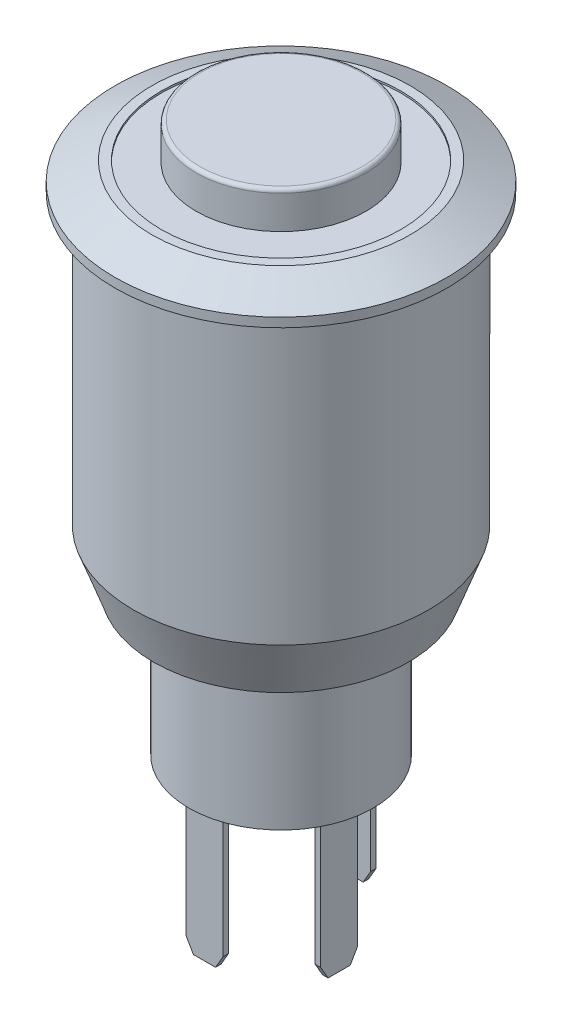
ISO-10303-21;
HEADER;
FILE_DESCRIPTION(('STEP AP214'),'2;1');
FILE_NAME('part.step','',(''),(''),'','','');
FILE_SCHEMA(('AUTOMOTIVE_DESIGN { 1 0 10303 214 1 1 1 1 }'));
ENDSEC;
DATA;
#1=APPLICATION_CONTEXT('core data for automotive mechanical design processes');
#2=APPLICATION_PROTOCOL_DEFINITION('international standard','automotive_design',2000,#1);
#3=PRODUCT_CONTEXT('',#1,'mechanical');
#4=PRODUCT('Part','Part','',(#3));
#5=PRODUCT_RELATED_PRODUCT_CATEGORY('part','',(#4));
#6=PRODUCT_DEFINITION_FORMATION('','',#4);
#7=PRODUCT_DEFINITION_CONTEXT('part definition',#1,'design');
#8=PRODUCT_DEFINITION('design','',#6,#7);
#9=PRODUCT_DEFINITION_SHAPE('','',#8);
#10=(LENGTH_UNIT() NAMED_UNIT(*) SI_UNIT(.MILLI.,.METRE.));
#11=(NAMED_UNIT(*) PLANE_ANGLE_UNIT() SI_UNIT($,.RADIAN.));
#12=(NAMED_UNIT(*) SI_UNIT($,.STERADIAN.) SOLID_ANGLE_UNIT());
#13=UNCERTAINTY_MEASURE_WITH_UNIT(LENGTH_MEASURE(1.E-05),#10,'distance_accuracy_value','');
#14=(GEOMETRIC_REPRESENTATION_CONTEXT(3) GLOBAL_UNCERTAINTY_ASSIGNED_CONTEXT((#13)) GLOBAL_UNIT_ASSIGNED_CONTEXT((#10,
#11,#12)) REPRESENTATION_CONTEXT('',''));
#15=CARTESIAN_POINT('',(0.,0.,0.));
#16=DIRECTION('',(0.,0.,1.));
#17=DIRECTION('',(1.,0.,0.));
#18=AXIS2_PLACEMENT_3D('',#15,#16,#17);
#19=CARTESIAN_POINT('',(0.,-26.4,5.));
#20=DIRECTION('',(0.,-1.,0.));
#21=DIRECTION('',(0.,0.,-1.));
#22=AXIS2_PLACEMENT_3D('',#19,#20,#21);
#23=PLANE('',#22);
#24=CARTESIAN_POINT('',(0.,-26.4,0.));
#25=DIRECTION('',(0.,1.,0.));
#26=DIRECTION('',(0.,0.,1.));
#27=AXIS2_PLACEMENT_3D('',#24,#25,#26);
#28=CIRCLE('',#27,5.);
#29=CARTESIAN_POINT('',(0.,-26.4,5.));
#30=VERTEX_POINT('',#29);
#31=EDGE_CURVE('E317',#30,#30,#28,.T.);
#32=ORIENTED_EDGE('',*,*,#31,.F.);
#33=EDGE_LOOP('',(#32));
#34=FACE_BOUND('',#33,.T.);
#35=DIRECTION('',(0.,0.,-1.));
#36=VECTOR('',#35,1.);
#37=CARTESIAN_POINT('',(0.999999999999999,-26.4,4.15));
#38=LINE('',#37,#36);
#39=CARTESIAN_POINT('',(0.999999999999999,-26.4,4.15));
#40=VERTEX_POINT('',#39);
#41=CARTESIAN_POINT('',(0.999999999999999,-26.4,3.85));
#42=VERTEX_POINT('',#41);
#43=EDGE_CURVE('E295',#40,#42,#38,.T.);
#44=ORIENTED_EDGE('',*,*,#43,.T.);
#45=DIRECTION('',(1.,0.,0.));
#46=VECTOR('',#45,1.);
#47=CARTESIAN_POINT('',(-1.,-26.4,3.85));
#48=LINE('',#47,#46);
#49=CARTESIAN_POINT('',(-1.,-26.4,3.85));
#50=VERTEX_POINT('',#49);
#51=EDGE_CURVE('E284',#50,#42,#48,.T.);
#52=ORIENTED_EDGE('',*,*,#51,.F.);
#53=DIRECTION('',(0.,0.,1.));
#54=VECTOR('',#53,1.);
#55=CARTESIAN_POINT('',(-1.,-26.4,3.85));
#56=LINE('',#55,#54);
#57=CARTESIAN_POINT('',(-1.,-26.4,4.15));
#58=VERTEX_POINT('',#57);
#59=EDGE_CURVE('E289',#50,#58,#56,.T.);
#60=ORIENTED_EDGE('',*,*,#59,.T.);
#61=DIRECTION('',(1.,0.,0.));
#62=VECTOR('',#61,1.);
#63=CARTESIAN_POINT('',(-1.,-26.4,4.15));
#64=LINE('',#63,#62);
#65=EDGE_CURVE('E298',#58,#40,#64,.T.);
#66=ORIENTED_EDGE('',*,*,#65,.T.);
#67=EDGE_LOOP('',(#44,#52,#60,#66));
#68=FACE_BOUND('',#67,.T.);
#69=DIRECTION('',(0.,0.,-1.));
#70=VECTOR('',#69,1.);
#71=CARTESIAN_POINT('',(0.999999999999999,-26.4,-3.85));
#72=LINE('',#71,#70);
#73=CARTESIAN_POINT('',(0.999999999999999,-26.4,-3.85));
#74=VERTEX_POINT('',#73);
#75=CARTESIAN_POINT('',(0.999999999999999,-26.4,-4.15));
#76=VERTEX_POINT('',#75);
#77=EDGE_CURVE('E269',#74,#76,#72,.T.);
#78=ORIENTED_EDGE('',*,*,#77,.T.);
#79=DIRECTION('',(1.,0.,0.));
#80=VECTOR('',#79,1.);
#81=CARTESIAN_POINT('',(-1.,-26.4,-4.15));
#82=LINE('',#81,#80);
#83=CARTESIAN_POINT('',(-1.,-26.4,-4.15));
#84=VERTEX_POINT('',#83);
#85=EDGE_CURVE('E258',#84,#76,#82,.T.);
#86=ORIENTED_EDGE('',*,*,#85,.F.);
#87=DIRECTION('',(0.,0.,1.));
#88=VECTOR('',#87,1.);
#89=CARTESIAN_POINT('',(-1.,-26.4,-4.15));
#90=LINE('',#89,#88);
#91=CARTESIAN_POINT('',(-1.,-26.4,-3.85));
#92=VERTEX_POINT('',#91);
#93=EDGE_CURVE('E263',#84,#92,#90,.T.);
#94=ORIENTED_EDGE('',*,*,#93,.T.);
#95=DIRECTION('',(1.,0.,0.));
#96=VECTOR('',#95,1.);
#97=CARTESIAN_POINT('',(-1.,-26.4,-3.85));
#98=LINE('',#97,#96);
#99=EDGE_CURVE('E272',#92,#74,#98,.T.);
#100=ORIENTED_EDGE('',*,*,#99,.T.);
#101=EDGE_LOOP('',(#78,#86,#94,#100));
#102=FACE_BOUND('',#101,.T.);
#103=DIRECTION('',(-1.,0.,0.));
#104=VECTOR('',#103,1.);
#105=CARTESIAN_POINT('',(-3.85,-26.4,-1.));
#106=LINE('',#105,#104);
#107=CARTESIAN_POINT('',(-3.85,-26.4,-1.));
#108=VERTEX_POINT('',#107);
#109=CARTESIAN_POINT('',(-4.15,-26.4,-1.));
#110=VERTEX_POINT('',#109);
#111=EDGE_CURVE('E243',#108,#110,#106,.T.);
#112=ORIENTED_EDGE('',*,*,#111,.T.);
#113=DIRECTION('',(0.,0.,1.));
#114=VECTOR('',#113,1.);
#115=CARTESIAN_POINT('',(-4.15,-26.4,1.));
#116=LINE('',#115,#114);
#117=CARTESIAN_POINT('',(-4.15,-26.4,1.));
#118=VERTEX_POINT('',#117);
#119=EDGE_CURVE('E232',#118,#110,#116,.F.);
#120=ORIENTED_EDGE('',*,*,#119,.F.);
#121=DIRECTION('',(1.,0.,0.));
#122=VECTOR('',#121,1.);
#123=CARTESIAN_POINT('',(-4.15,-26.4,1.));
#124=LINE('',#123,#122);
#125=CARTESIAN_POINT('',(-3.85,-26.4,1.));
#126=VERTEX_POINT('',#125);
#127=EDGE_CURVE('E237',#118,#126,#124,.T.);
#128=ORIENTED_EDGE('',*,*,#127,.T.);
#129=DIRECTION('',(0.,0.,1.));
#130=VECTOR('',#129,1.);
#131=CARTESIAN_POINT('',(-3.85,-26.4,1.));
#132=LINE('',#131,#130);
#133=EDGE_CURVE('E246',#126,#108,#132,.F.);
#134=ORIENTED_EDGE('',*,*,#133,.T.);
#135=EDGE_LOOP('',(#112,#120,#128,#134));
#136=FACE_BOUND('',#135,.T.);
#137=DIRECTION('',(1.,0.,0.));
#138=VECTOR('',#137,1.);
#139=CARTESIAN_POINT('',(3.85,-26.4,2.));
#140=LINE('',#139,#138);
#141=CARTESIAN_POINT('',(3.85,-26.4,2.));
#142=VERTEX_POINT('',#141);
#143=CARTESIAN_POINT('',(4.15,-26.4,2.));
#144=VERTEX_POINT('',#143);
#145=EDGE_CURVE('E216',#142,#144,#140,.T.);
#146=ORIENTED_EDGE('',*,*,#145,.T.);
#147=DIRECTION('',(0.,0.,1.));
#148=VECTOR('',#147,1.);
#149=CARTESIAN_POINT('',(4.15,-26.4,0.));
#150=LINE('',#149,#148);
#151=CARTESIAN_POINT('',(4.15,-26.4,0.));
#152=VERTEX_POINT('',#151);
#153=EDGE_CURVE('E199',#152,#144,#150,.T.);
#154=ORIENTED_EDGE('',*,*,#153,.F.);
#155=DIRECTION('',(-1.,0.,0.));
#156=VECTOR('',#155,1.);
#157=CARTESIAN_POINT('',(4.15,-26.4,0.));
#158=LINE('',#157,#156);
#159=CARTESIAN_POINT('',(3.85,-26.4,0.));
#160=VERTEX_POINT('',#159);
#161=EDGE_CURVE('E213',#152,#160,#158,.T.);
#162=ORIENTED_EDGE('',*,*,#161,.T.);
#163=DIRECTION('',(0.,0.,1.));
#164=VECTOR('',#163,1.);
#165=CARTESIAN_POINT('',(3.85,-26.4,0.));
#166=LINE('',#165,#164);
#167=EDGE_CURVE('E221',#160,#142,#166,.T.);
#168=ORIENTED_EDGE('',*,*,#167,.T.);
#169=EDGE_LOOP('',(#146,#154,#162,#168));
#170=FACE_BOUND('',#169,.T.);
#171=ADVANCED_FACE('F35',(#34,#68,#102,#136,#170),#23,.T.);
#172=CARTESIAN_POINT('',(0.,1.5,4.6));
#173=DIRECTION('',(0.,1.,0.));
#174=DIRECTION('',(0.,0.,1.));
#175=AXIS2_PLACEMENT_3D('',#172,#173,#174);
#176=PLANE('',#175);
#177=CARTESIAN_POINT('',(0.,1.5,0.));
#178=DIRECTION('',(0.,1.,0.));
#179=DIRECTION('',(0.,0.,1.));
#180=AXIS2_PLACEMENT_3D('',#177,#178,#179);
#181=CIRCLE('',#180,6.5);
#182=CARTESIAN_POINT('',(0.,1.5,6.5));
#183=VERTEX_POINT('',#182);
#184=EDGE_CURVE('E313',#183,#183,#181,.T.);
#185=ORIENTED_EDGE('',*,*,#184,.F.);
#186=EDGE_LOOP('',(#185));
#187=FACE_BOUND('',#186,.T.);
#188=CARTESIAN_POINT('',(0.,1.5,0.));
#189=DIRECTION('',(0.,1.,0.));
#190=DIRECTION('',(0.,0.,1.));
#191=AXIS2_PLACEMENT_3D('',#188,#189,#190);
#192=CIRCLE('',#191,7.);
#193=CARTESIAN_POINT('',(0.,1.5,7.));
#194=VERTEX_POINT('',#193);
#195=EDGE_CURVE('E334',#194,#194,#192,.T.);
#196=ORIENTED_EDGE('',*,*,#195,.T.);
#197=EDGE_LOOP('',(#196));
#198=FACE_BOUND('',#197,.T.);
#199=ADVANCED_FACE('F425',(#187,#198),#176,.T.);
#200=CARTESIAN_POINT('',(0.,1.5,0.));
#201=DIRECTION('',(0.,-1.,0.));
#202=DIRECTION('',(0.,0.,-1.));
#203=AXIS2_PLACEMENT_3D('',#200,#201,#202);
#204=CONICAL_SURFACE('',#203,7.,1.10714871779409);
#205=CARTESIAN_POINT('',(0.,0.5,0.));
#206=DIRECTION('',(0.,1.,0.));
#207=DIRECTION('',(0.,0.,1.));
#208=AXIS2_PLACEMENT_3D('',#205,#206,#207);
#209=CIRCLE('',#208,9.);
#210=CARTESIAN_POINT('',(0.,0.5,9.));
#211=VERTEX_POINT('',#210);
#212=EDGE_CURVE('E331',#211,#211,#209,.T.);
#213=ORIENTED_EDGE('',*,*,#212,.T.);
#214=EDGE_LOOP('',(#213));
#215=FACE_BOUND('',#214,.T.);
#216=ORIENTED_EDGE('',*,*,#195,.F.);
#217=EDGE_LOOP('',(#216));
#218=FACE_BOUND('',#217,.T.);
#219=ADVANCED_FACE('F431',(#215,#218),#204,.T.);
#220=CARTESIAN_POINT('',(0.,14.375,0.));
#221=DIRECTION('',(0.,1.,0.));
#222=DIRECTION('',(0.,0.,1.));
#223=AXIS2_PLACEMENT_3D('',#220,#221,#222);
#224=CYLINDRICAL_SURFACE('',#223,9.);
#225=CARTESIAN_POINT('',(0.,0.,0.));
#226=DIRECTION('',(0.,1.,0.));
#227=DIRECTION('',(0.,0.,1.));
#228=AXIS2_PLACEMENT_3D('',#225,#226,#227);
#229=CIRCLE('',#228,9.);
#230=CARTESIAN_POINT('',(0.,0.,9.));
#231=VERTEX_POINT('',#230);
#232=EDGE_CURVE('E328',#231,#231,#229,.T.);
#233=ORIENTED_EDGE('',*,*,#232,.T.);
#234=EDGE_LOOP('',(#233));
#235=FACE_BOUND('',#234,.T.);
#236=ORIENTED_EDGE('',*,*,#212,.F.);
#237=EDGE_LOOP('',(#236));
#238=FACE_BOUND('',#237,.T.);
#239=ADVANCED_FACE('F453',(#235,#238),#224,.T.);
#240=CARTESIAN_POINT('',(0.,0.,9.));
#241=DIRECTION('',(0.,-1.,0.));
#242=DIRECTION('',(0.,0.,-1.));
#243=AXIS2_PLACEMENT_3D('',#240,#241,#242);
#244=PLANE('',#243);
#245=CARTESIAN_POINT('',(0.,0.,0.));
#246=DIRECTION('',(0.,1.,0.));
#247=DIRECTION('',(0.,0.,1.));
#248=AXIS2_PLACEMENT_3D('',#245,#246,#247);
#249=CIRCLE('',#248,8.);
#250=CARTESIAN_POINT('',(0.,0.,8.));
#251=VERTEX_POINT('',#250);
#252=EDGE_CURVE('E325',#251,#251,#249,.T.);
#253=ORIENTED_EDGE('',*,*,#252,.T.);
#254=EDGE_LOOP('',(#253));
#255=FACE_BOUND('',#254,.T.);
#256=ORIENTED_EDGE('',*,*,#232,.F.);
#257=EDGE_LOOP('',(#256));
#258=FACE_BOUND('',#257,.T.);
#259=ADVANCED_FACE('F450',(#255,#258),#244,.T.);
#260=CARTESIAN_POINT('',(0.,14.375,0.));
#261=DIRECTION('',(0.,1.,0.));
#262=DIRECTION('',(0.,0.,1.));
#263=AXIS2_PLACEMENT_3D('',#260,#261,#262);
#264=CYLINDRICAL_SURFACE('',#263,8.);
#265=CARTESIAN_POINT('',(0.,-15.6,0.));
#266=DIRECTION('',(0.,-1.,0.));
#267=DIRECTION('',(0.,0.,-1.));
#268=AXIS2_PLACEMENT_3D('',#265,#266,#267);
#269=CIRCLE('',#268,8.);
#270=CARTESIAN_POINT('',(0.,-15.6,-8.));
#271=VERTEX_POINT('',#270);
#272=EDGE_CURVE('E43',#271,#271,#269,.F.);
#273=ORIENTED_EDGE('',*,*,#272,.T.);
#274=EDGE_LOOP('',(#273));
#275=FACE_BOUND('',#274,.T.);
#276=ORIENTED_EDGE('',*,*,#252,.F.);
#277=EDGE_LOOP('',(#276));
#278=FACE_BOUND('',#277,.T.);
#279=ADVANCED_FACE('F413',(#275,#278),#264,.T.);
#280=CARTESIAN_POINT('',(0.,-18.6,8.));
#281=DIRECTION('',(0.,-1.,0.));
#282=DIRECTION('',(0.,0.,-1.));
#283=AXIS2_PLACEMENT_3D('',#280,#281,#282);
#284=PLANE('',#283);
#285=CARTESIAN_POINT('',(0.,-18.6,0.));
#286=DIRECTION('',(0.,-1.,0.));
#287=DIRECTION('',(0.,0.,-1.));
#288=AXIS2_PLACEMENT_3D('',#285,#286,#287);
#289=CIRCLE('',#288,6.90808929720139);
#290=CARTESIAN_POINT('',(0.,-18.6,-6.90808929720139));
#291=VERTEX_POINT('',#290);
#292=EDGE_CURVE('E11',#291,#291,#289,.T.);
#293=ORIENTED_EDGE('',*,*,#292,.T.);
#294=EDGE_LOOP('',(#293));
#295=FACE_BOUND('',#294,.T.);
#296=CARTESIAN_POINT('',(0.,-18.6,0.));
#297=DIRECTION('',(0.,1.,0.));
#298=DIRECTION('',(0.,0.,1.));
#299=AXIS2_PLACEMENT_3D('',#296,#297,#298);
#300=CIRCLE('',#299,5.);
#301=CARTESIAN_POINT('',(0.,-18.6,5.));
#302=VERTEX_POINT('',#301);
#303=EDGE_CURVE('E322',#302,#302,#300,.T.);
#304=ORIENTED_EDGE('',*,*,#303,.T.);
#305=EDGE_LOOP('',(#304));
#306=FACE_BOUND('',#305,.T.);
#307=ADVANCED_FACE('F443',(#295,#306),#284,.T.);
#308=CARTESIAN_POINT('',(0.,14.375,0.));
#309=DIRECTION('',(0.,1.,0.));
#310=DIRECTION('',(0.,0.,1.));
#311=AXIS2_PLACEMENT_3D('',#308,#309,#310);
#312=CYLINDRICAL_SURFACE('',#311,5.);
#313=ORIENTED_EDGE('',*,*,#31,.T.);
#314=EDGE_LOOP('',(#313));
#315=FACE_BOUND('',#314,.T.);
#316=ORIENTED_EDGE('',*,*,#303,.F.);
#317=EDGE_LOOP('',(#316));
#318=FACE_BOUND('',#317,.T.);
#319=ADVANCED_FACE('F440',(#315,#318),#312,.T.);
#320=CARTESIAN_POINT('',(0.,1.4,0.));
#321=DIRECTION('',(0.,1.,0.));
#322=DIRECTION('',(0.,0.,1.));
#323=AXIS2_PLACEMENT_3D('',#320,#321,#322);
#324=CYLINDRICAL_SURFACE('',#323,6.5);
#325=CARTESIAN_POINT('',(0.,1.4,0.));
#326=DIRECTION('',(0.,1.,0.));
#327=DIRECTION('',(0.,0.,1.));
#328=AXIS2_PLACEMENT_3D('',#325,#326,#327);
#329=CIRCLE('',#328,6.5);
#330=CARTESIAN_POINT('',(0.,1.4,6.5));
#331=VERTEX_POINT('',#330);
#332=EDGE_CURVE('E314',#331,#331,#329,.T.);
#333=ORIENTED_EDGE('',*,*,#332,.F.);
#334=EDGE_LOOP('',(#333));
#335=FACE_BOUND('',#334,.T.);
#336=ORIENTED_EDGE('',*,*,#184,.T.);
#337=EDGE_LOOP('',(#336));
#338=FACE_BOUND('',#337,.T.);
#339=ADVANCED_FACE('F438',(#335,#338),#324,.F.);
#340=CARTESIAN_POINT('',(0.,1.4,0.));
#341=DIRECTION('',(0.,1.,0.));
#342=DIRECTION('',(0.,0.,1.));
#343=AXIS2_PLACEMENT_3D('',#340,#341,#342);
#344=PLANE('',#343);
#345=CARTESIAN_POINT('',(0.,1.4,0.));
#346=DIRECTION('',(0.,1.,0.));
#347=DIRECTION('',(0.,0.,1.));
#348=AXIS2_PLACEMENT_3D('',#345,#346,#347);
#349=CIRCLE('',#348,4.6);
#350=CARTESIAN_POINT('',(0.,1.4,4.6));
#351=VERTEX_POINT('',#350);
#352=EDGE_CURVE('E310',#351,#351,#349,.T.);
#353=ORIENTED_EDGE('',*,*,#352,.F.);
#354=EDGE_LOOP('',(#353));
#355=FACE_BOUND('',#354,.T.);
#356=ORIENTED_EDGE('',*,*,#332,.T.);
#357=EDGE_LOOP('',(#356));
#358=FACE_BOUND('',#357,.T.);
#359=ADVANCED_FACE('F470',(#355,#358),#344,.T.);
#360=CARTESIAN_POINT('',(0.,3.4,0.));
#361=DIRECTION('',(0.,1.,0.));
#362=DIRECTION('',(0.,0.,1.));
#363=AXIS2_PLACEMENT_3D('',#360,#361,#362);
#364=PLANE('',#363);
#365=CARTESIAN_POINT('',(0.,3.4,0.));
#366=DIRECTION('',(0.,1.,0.));
#367=DIRECTION('',(0.,0.,1.));
#368=AXIS2_PLACEMENT_3D('',#365,#366,#367);
#369=CIRCLE('',#368,4.4);
#370=CARTESIAN_POINT('',(0.,3.4,4.4));
#371=VERTEX_POINT('',#370);
#372=EDGE_CURVE('E337',#371,#371,#369,.T.);
#373=ORIENTED_EDGE('',*,*,#372,.T.);
#374=EDGE_LOOP('',(#373));
#375=FACE_BOUND('',#374,.T.);
#376=ADVANCED_FACE('F467',(#375),#364,.T.);
#377=CARTESIAN_POINT('',(0.,3.2,0.));
#378=DIRECTION('',(0.,1.,0.));
#379=DIRECTION('',(0.,0.,1.));
#380=AXIS2_PLACEMENT_3D('',#377,#378,#379);
#381=TOROIDAL_SURFACE('',#380,4.4,0.2);
#382=CARTESIAN_POINT('',(0.,3.2,0.));
#383=DIRECTION('',(0.,1.,0.));
#384=DIRECTION('',(0.,0.,1.));
#385=AXIS2_PLACEMENT_3D('',#382,#383,#384);
#386=CIRCLE('',#385,4.6);
#387=CARTESIAN_POINT('',(0.,3.2,4.6));
#388=VERTEX_POINT('',#387);
#389=EDGE_CURVE('E340',#388,#388,#386,.F.);
#390=ORIENTED_EDGE('',*,*,#389,.F.);
#391=EDGE_LOOP('',(#390));
#392=FACE_BOUND('',#391,.T.);
#393=ORIENTED_EDGE('',*,*,#372,.F.);
#394=EDGE_LOOP('',(#393));
#395=FACE_BOUND('',#394,.T.);
#396=ADVANCED_FACE('F465',(#392,#395),#381,.T.);
#397=CARTESIAN_POINT('',(0.,14.375,0.));
#398=DIRECTION('',(0.,1.,0.));
#399=DIRECTION('',(0.,0.,1.));
#400=AXIS2_PLACEMENT_3D('',#397,#398,#399);
#401=CYLINDRICAL_SURFACE('',#400,4.6);
#402=ORIENTED_EDGE('',*,*,#389,.T.);
#403=EDGE_LOOP('',(#402));
#404=FACE_BOUND('',#403,.T.);
#405=ORIENTED_EDGE('',*,*,#352,.T.);
#406=EDGE_LOOP('',(#405));
#407=FACE_BOUND('',#406,.T.);
#408=ADVANCED_FACE('F461',(#404,#407),#401,.T.);
#409=CARTESIAN_POINT('',(-1.,-34.,3.85));
#410=DIRECTION('',(0.,0.,1.));
#411=DIRECTION('',(1.,0.,0.));
#412=AXIS2_PLACEMENT_3D('',#409,#410,#411);
#413=PLANE('',#412);
#414=DIRECTION('',(1.,0.,0.));
#415=VECTOR('',#414,1.);
#416=CARTESIAN_POINT('',(-1.,-34.,3.85));
#417=LINE('',#416,#415);
#418=CARTESIAN_POINT('',(-0.6,-34.,3.85));
#419=VERTEX_POINT('',#418);
#420=CARTESIAN_POINT('',(0.599999999999998,-34.,3.85));
#421=VERTEX_POINT('',#420);
#422=EDGE_CURVE('E285',#419,#421,#417,.T.);
#423=ORIENTED_EDGE('',*,*,#422,.F.);
#424=DIRECTION('',(-0.499999999999996,0.866025403784441,0.));
#425=VECTOR('',#424,1.);
#426=CARTESIAN_POINT('',(-1.,-33.3071796769724,3.85));
#427=LINE('',#426,#425);
#428=CARTESIAN_POINT('',(-1.,-33.3071796769724,3.85));
#429=VERTEX_POINT('',#428);
#430=EDGE_CURVE('E356',#419,#429,#427,.T.);
#431=ORIENTED_EDGE('',*,*,#430,.T.);
#432=DIRECTION('',(0.,1.,0.));
#433=VECTOR('',#432,1.);
#434=CARTESIAN_POINT('',(-1.,-34.,3.85));
#435=LINE('',#434,#433);
#436=EDGE_CURVE('E292',#429,#50,#435,.T.);
#437=ORIENTED_EDGE('',*,*,#436,.T.);
#438=ORIENTED_EDGE('',*,*,#51,.T.);
#439=DIRECTION('',(0.,1.,0.));
#440=VECTOR('',#439,1.);
#441=CARTESIAN_POINT('',(0.999999999999999,-34.,3.85));
#442=LINE('',#441,#440);
#443=CARTESIAN_POINT('',(0.999999999999999,-33.3071796769724,3.85));
#444=VERTEX_POINT('',#443);
#445=EDGE_CURVE('E308',#444,#42,#442,.T.);
#446=ORIENTED_EDGE('',*,*,#445,.F.);
#447=DIRECTION('',(-0.499999999999996,-0.866025403784441,0.));
#448=VECTOR('',#447,1.);
#449=CARTESIAN_POINT('',(0.999999999999999,-33.3071796769724,3.85));
#450=LINE('',#449,#448);
#451=EDGE_CURVE('E354',#444,#421,#450,.T.);
#452=ORIENTED_EDGE('',*,*,#451,.T.);
#453=EDGE_LOOP('',(#423,#431,#437,#438,#446,#452));
#454=FACE_BOUND('',#453,.T.);
#455=ADVANCED_FACE('F464',(#454),#413,.F.);
#456=CARTESIAN_POINT('',(0.999999999999999,-34.,4.15));
#457=DIRECTION('',(1.,0.,0.));
#458=DIRECTION('',(0.,0.,-1.));
#459=AXIS2_PLACEMENT_3D('',#456,#457,#458);
#460=PLANE('',#459);
#461=DIRECTION('',(0.,1.,0.));
#462=VECTOR('',#461,1.);
#463=CARTESIAN_POINT('',(0.999999999999999,-34.,4.15));
#464=LINE('',#463,#462);
#465=CARTESIAN_POINT('',(0.999999999999999,-33.3071796769724,4.15));
#466=VERTEX_POINT('',#465);
#467=EDGE_CURVE('E306',#466,#40,#464,.T.);
#468=ORIENTED_EDGE('',*,*,#467,.F.);
#469=DIRECTION('',(0.,0.,-1.));
#470=VECTOR('',#469,1.);
#471=CARTESIAN_POINT('',(0.999999999999999,-33.3071796769724,3.85));
#472=LINE('',#471,#470);
#473=EDGE_CURVE('E358',#466,#444,#472,.T.);
#474=ORIENTED_EDGE('',*,*,#473,.T.);
#475=ORIENTED_EDGE('',*,*,#445,.T.);
#476=ORIENTED_EDGE('',*,*,#43,.F.);
#477=EDGE_LOOP('',(#468,#474,#475,#476));
#478=FACE_BOUND('',#477,.T.);
#479=ADVANCED_FACE('F579',(#478),#460,.T.);
#480=CARTESIAN_POINT('',(-1.,-34.,4.15));
#481=DIRECTION('',(0.,0.,1.));
#482=DIRECTION('',(1.,0.,0.));
#483=AXIS2_PLACEMENT_3D('',#480,#481,#482);
#484=PLANE('',#483);
#485=DIRECTION('',(0.,1.,0.));
#486=VECTOR('',#485,1.);
#487=CARTESIAN_POINT('',(-1.,-34.,4.15));
#488=LINE('',#487,#486);
#489=CARTESIAN_POINT('',(-1.,-33.3071796769724,4.15));
#490=VERTEX_POINT('',#489);
#491=EDGE_CURVE('E304',#490,#58,#488,.T.);
#492=ORIENTED_EDGE('',*,*,#491,.F.);
#493=DIRECTION('',(0.499999999999996,-0.866025403784441,0.));
#494=VECTOR('',#493,1.);
#495=CARTESIAN_POINT('',(-0.699999999999998,-33.8267949192431,4.15));
#496=LINE('',#495,#494);
#497=CARTESIAN_POINT('',(-0.6,-34.,4.15));
#498=VERTEX_POINT('',#497);
#499=EDGE_CURVE('E348',#490,#498,#496,.T.);
#500=ORIENTED_EDGE('',*,*,#499,.T.);
#501=DIRECTION('',(1.,0.,0.));
#502=VECTOR('',#501,1.);
#503=CARTESIAN_POINT('',(-1.,-34.,4.15));
#504=LINE('',#503,#502);
#505=CARTESIAN_POINT('',(0.599999999999998,-34.,4.15));
#506=VERTEX_POINT('',#505);
#507=EDGE_CURVE('E288',#498,#506,#504,.T.);
#508=ORIENTED_EDGE('',*,*,#507,.T.);
#509=DIRECTION('',(0.499999999999996,0.866025403784441,0.));
#510=VECTOR('',#509,1.);
#511=CARTESIAN_POINT('',(0.200000000000005,-34.6928203230275,4.15));
#512=LINE('',#511,#510);
#513=EDGE_CURVE('E346',#506,#466,#512,.T.);
#514=ORIENTED_EDGE('',*,*,#513,.T.);
#515=ORIENTED_EDGE('',*,*,#467,.T.);
#516=ORIENTED_EDGE('',*,*,#65,.F.);
#517=EDGE_LOOP('',(#492,#500,#508,#514,#515,#516));
#518=FACE_BOUND('',#517,.T.);
#519=ADVANCED_FACE('F575',(#518),#484,.T.);
#520=CARTESIAN_POINT('',(-1.,-34.,3.85));
#521=DIRECTION('',(-1.,0.,0.));
#522=DIRECTION('',(0.,0.,1.));
#523=AXIS2_PLACEMENT_3D('',#520,#521,#522);
#524=PLANE('',#523);
#525=ORIENTED_EDGE('',*,*,#436,.F.);
#526=DIRECTION('',(0.,0.,1.));
#527=VECTOR('',#526,1.);
#528=CARTESIAN_POINT('',(-1.,-33.3071796769724,4.15));
#529=LINE('',#528,#527);
#530=EDGE_CURVE('E343',#429,#490,#529,.T.);
#531=ORIENTED_EDGE('',*,*,#530,.T.);
#532=ORIENTED_EDGE('',*,*,#491,.T.);
#533=ORIENTED_EDGE('',*,*,#59,.F.);
#534=EDGE_LOOP('',(#525,#531,#532,#533));
#535=FACE_BOUND('',#534,.T.);
#536=ADVANCED_FACE('F571',(#535),#524,.T.);
#537=CARTESIAN_POINT('',(0.,-34.,0.));
#538=DIRECTION('',(0.,1.,0.));
#539=DIRECTION('',(-1.,0.,0.));
#540=AXIS2_PLACEMENT_3D('',#537,#538,#539);
#541=PLANE('',#540);
#542=ORIENTED_EDGE('',*,*,#507,.F.);
#543=DIRECTION('',(0.,0.,-1.));
#544=VECTOR('',#543,1.);
#545=CARTESIAN_POINT('',(-0.6,-34.,3.85));
#546=LINE('',#545,#544);
#547=EDGE_CURVE('E352',#498,#419,#546,.T.);
#548=ORIENTED_EDGE('',*,*,#547,.T.);
#549=ORIENTED_EDGE('',*,*,#422,.T.);
#550=DIRECTION('',(0.,0.,1.));
#551=VECTOR('',#550,1.);
#552=CARTESIAN_POINT('',(0.599999999999998,-34.,4.15));
#553=LINE('',#552,#551);
#554=EDGE_CURVE('E350',#421,#506,#553,.T.);
#555=ORIENTED_EDGE('',*,*,#554,.T.);
#556=EDGE_LOOP('',(#542,#548,#549,#555));
#557=FACE_BOUND('',#556,.T.);
#558=ADVANCED_FACE('F567',(#557),#541,.F.);
#559=CARTESIAN_POINT('',(-1.,-34.,-4.15));
#560=DIRECTION('',(0.,0.,1.));
#561=DIRECTION('',(1.,0.,0.));
#562=AXIS2_PLACEMENT_3D('',#559,#560,#561);
#563=PLANE('',#562);
#564=DIRECTION('',(1.,0.,0.));
#565=VECTOR('',#564,1.);
#566=CARTESIAN_POINT('',(-1.,-34.,-4.15));
#567=LINE('',#566,#565);
#568=CARTESIAN_POINT('',(-0.6,-34.,-4.15));
#569=VERTEX_POINT('',#568);
#570=CARTESIAN_POINT('',(0.599999999999998,-34.,-4.15));
#571=VERTEX_POINT('',#570);
#572=EDGE_CURVE('E259',#569,#571,#567,.T.);
#573=ORIENTED_EDGE('',*,*,#572,.F.);
#574=DIRECTION('',(-0.499999999999996,0.866025403784441,0.));
#575=VECTOR('',#574,1.);
#576=CARTESIAN_POINT('',(-1.,-33.3071796769724,-4.15));
#577=LINE('',#576,#575);
#578=CARTESIAN_POINT('',(-1.,-33.3071796769724,-4.15));
#579=VERTEX_POINT('',#578);
#580=EDGE_CURVE('E392',#569,#579,#577,.T.);
#581=ORIENTED_EDGE('',*,*,#580,.T.);
#582=DIRECTION('',(0.,1.,0.));
#583=VECTOR('',#582,1.);
#584=CARTESIAN_POINT('',(-1.,-34.,-4.15));
#585=LINE('',#584,#583);
#586=EDGE_CURVE('E266',#579,#84,#585,.T.);
#587=ORIENTED_EDGE('',*,*,#586,.T.);
#588=ORIENTED_EDGE('',*,*,#85,.T.);
#589=DIRECTION('',(0.,1.,0.));
#590=VECTOR('',#589,1.);
#591=CARTESIAN_POINT('',(0.999999999999999,-34.,-4.15));
#592=LINE('',#591,#590);
#593=CARTESIAN_POINT('',(0.999999999999999,-33.3071796769724,-4.15));
#594=VERTEX_POINT('',#593);
#595=EDGE_CURVE('E282',#594,#76,#592,.T.);
#596=ORIENTED_EDGE('',*,*,#595,.F.);
#597=DIRECTION('',(-0.499999999999996,-0.866025403784441,0.));
#598=VECTOR('',#597,1.);
#599=CARTESIAN_POINT('',(0.999999999999999,-33.3071796769724,-4.15));
#600=LINE('',#599,#598);
#601=EDGE_CURVE('E390',#594,#571,#600,.T.);
#602=ORIENTED_EDGE('',*,*,#601,.T.);
#603=EDGE_LOOP('',(#573,#581,#587,#588,#596,#602));
#604=FACE_BOUND('',#603,.T.);
#605=ADVANCED_FACE('F563',(#604),#563,.F.);
#606=CARTESIAN_POINT('',(0.999999999999999,-34.,-3.85));
#607=DIRECTION('',(1.,0.,0.));
#608=DIRECTION('',(0.,0.,-1.));
#609=AXIS2_PLACEMENT_3D('',#606,#607,#608);
#610=PLANE('',#609);
#611=DIRECTION('',(0.,1.,0.));
#612=VECTOR('',#611,1.);
#613=CARTESIAN_POINT('',(0.999999999999999,-34.,-3.85));
#614=LINE('',#613,#612);
#615=CARTESIAN_POINT('',(0.999999999999999,-33.3071796769724,-3.85));
#616=VERTEX_POINT('',#615);
#617=EDGE_CURVE('E280',#616,#74,#614,.T.);
#618=ORIENTED_EDGE('',*,*,#617,.F.);
#619=DIRECTION('',(0.,0.,-1.));
#620=VECTOR('',#619,1.);
#621=CARTESIAN_POINT('',(0.999999999999999,-33.3071796769724,-4.15));
#622=LINE('',#621,#620);
#623=EDGE_CURVE('E394',#616,#594,#622,.T.);
#624=ORIENTED_EDGE('',*,*,#623,.T.);
#625=ORIENTED_EDGE('',*,*,#595,.T.);
#626=ORIENTED_EDGE('',*,*,#77,.F.);
#627=EDGE_LOOP('',(#618,#624,#625,#626));
#628=FACE_BOUND('',#627,.T.);
#629=ADVANCED_FACE('F559',(#628),#610,.T.);
#630=CARTESIAN_POINT('',(-1.,-34.,-3.85));
#631=DIRECTION('',(0.,0.,1.));
#632=DIRECTION('',(1.,0.,0.));
#633=AXIS2_PLACEMENT_3D('',#630,#631,#632);
#634=PLANE('',#633);
#635=DIRECTION('',(0.,1.,0.));
#636=VECTOR('',#635,1.);
#637=CARTESIAN_POINT('',(-1.,-34.,-3.85));
#638=LINE('',#637,#636);
#639=CARTESIAN_POINT('',(-1.,-33.3071796769724,-3.85));
#640=VERTEX_POINT('',#639);
#641=EDGE_CURVE('E278',#640,#92,#638,.T.);
#642=ORIENTED_EDGE('',*,*,#641,.F.);
#643=DIRECTION('',(0.499999999999996,-0.866025403784441,0.));
#644=VECTOR('',#643,1.);
#645=CARTESIAN_POINT('',(-0.699999999999998,-33.8267949192431,-3.85));
#646=LINE('',#645,#644);
#647=CARTESIAN_POINT('',(-0.6,-34.,-3.85));
#648=VERTEX_POINT('',#647);
#649=EDGE_CURVE('E384',#640,#648,#646,.T.);
#650=ORIENTED_EDGE('',*,*,#649,.T.);
#651=DIRECTION('',(1.,0.,0.));
#652=VECTOR('',#651,1.);
#653=CARTESIAN_POINT('',(-1.,-34.,-3.85));
#654=LINE('',#653,#652);
#655=CARTESIAN_POINT('',(0.599999999999998,-34.,-3.85));
#656=VERTEX_POINT('',#655);
#657=EDGE_CURVE('E262',#648,#656,#654,.T.);
#658=ORIENTED_EDGE('',*,*,#657,.T.);
#659=DIRECTION('',(0.499999999999996,0.866025403784441,0.));
#660=VECTOR('',#659,1.);
#661=CARTESIAN_POINT('',(0.200000000000005,-34.6928203230275,-3.85));
#662=LINE('',#661,#660);
#663=EDGE_CURVE('E382',#656,#616,#662,.T.);
#664=ORIENTED_EDGE('',*,*,#663,.T.);
#665=ORIENTED_EDGE('',*,*,#617,.T.);
#666=ORIENTED_EDGE('',*,*,#99,.F.);
#667=EDGE_LOOP('',(#642,#650,#658,#664,#665,#666));
#668=FACE_BOUND('',#667,.T.);
#669=ADVANCED_FACE('F555',(#668),#634,.T.);
#670=CARTESIAN_POINT('',(-1.,-34.,-4.15));
#671=DIRECTION('',(-1.,0.,0.));
#672=DIRECTION('',(0.,0.,1.));
#673=AXIS2_PLACEMENT_3D('',#670,#671,#672);
#674=PLANE('',#673);
#675=ORIENTED_EDGE('',*,*,#586,.F.);
#676=DIRECTION('',(0.,0.,1.));
#677=VECTOR('',#676,1.);
#678=CARTESIAN_POINT('',(-1.,-33.3071796769724,-3.85));
#679=LINE('',#678,#677);
#680=EDGE_CURVE('E379',#579,#640,#679,.T.);
#681=ORIENTED_EDGE('',*,*,#680,.T.);
#682=ORIENTED_EDGE('',*,*,#641,.T.);
#683=ORIENTED_EDGE('',*,*,#93,.F.);
#684=EDGE_LOOP('',(#675,#681,#682,#683));
#685=FACE_BOUND('',#684,.T.);
#686=ADVANCED_FACE('F551',(#685),#674,.T.);
#687=CARTESIAN_POINT('',(0.,-34.,0.));
#688=DIRECTION('',(0.,1.,0.));
#689=DIRECTION('',(-1.,0.,0.));
#690=AXIS2_PLACEMENT_3D('',#687,#688,#689);
#691=PLANE('',#690);
#692=ORIENTED_EDGE('',*,*,#657,.F.);
#693=DIRECTION('',(0.,0.,-1.));
#694=VECTOR('',#693,1.);
#695=CARTESIAN_POINT('',(-0.6,-34.,-4.15));
#696=LINE('',#695,#694);
#697=EDGE_CURVE('E388',#648,#569,#696,.T.);
#698=ORIENTED_EDGE('',*,*,#697,.T.);
#699=ORIENTED_EDGE('',*,*,#572,.T.);
#700=DIRECTION('',(0.,0.,1.));
#701=VECTOR('',#700,1.);
#702=CARTESIAN_POINT('',(0.599999999999998,-34.,-3.85));
#703=LINE('',#702,#701);
#704=EDGE_CURVE('E386',#571,#656,#703,.T.);
#705=ORIENTED_EDGE('',*,*,#704,.T.);
#706=EDGE_LOOP('',(#692,#698,#699,#705));
#707=FACE_BOUND('',#706,.T.);
#708=ADVANCED_FACE('F547',(#707),#691,.F.);
#709=CARTESIAN_POINT('',(-4.15,-34.,1.));
#710=DIRECTION('',(1.,0.,0.));
#711=DIRECTION('',(0.,0.,-1.));
#712=AXIS2_PLACEMENT_3D('',#709,#710,#711);
#713=PLANE('',#712);
#714=DIRECTION('',(0.,0.,1.));
#715=VECTOR('',#714,1.);
#716=CARTESIAN_POINT('',(-4.15,-34.,1.));
#717=LINE('',#716,#715);
#718=CARTESIAN_POINT('',(-4.15,-34.,0.599999999999999));
#719=VERTEX_POINT('',#718);
#720=CARTESIAN_POINT('',(-4.15,-34.,-0.599999999999999));
#721=VERTEX_POINT('',#720);
#722=EDGE_CURVE('E233',#719,#721,#717,.F.);
#723=ORIENTED_EDGE('',*,*,#722,.F.);
#724=DIRECTION('',(0.,-0.866025403784441,-0.499999999999996));
#725=VECTOR('',#724,1.);
#726=CARTESIAN_POINT('',(-4.15,-33.3071796769724,1.));
#727=LINE('',#726,#725);
#728=CARTESIAN_POINT('',(-4.15,-33.3071796769724,1.));
#729=VERTEX_POINT('',#728);
#730=EDGE_CURVE('E374',#719,#729,#727,.F.);
#731=ORIENTED_EDGE('',*,*,#730,.T.);
#732=DIRECTION('',(0.,1.,0.));
#733=VECTOR('',#732,1.);
#734=CARTESIAN_POINT('',(-4.15,-34.,1.));
#735=LINE('',#734,#733);
#736=EDGE_CURVE('E240',#729,#118,#735,.T.);
#737=ORIENTED_EDGE('',*,*,#736,.T.);
#738=ORIENTED_EDGE('',*,*,#119,.T.);
#739=DIRECTION('',(0.,1.,0.));
#740=VECTOR('',#739,1.);
#741=CARTESIAN_POINT('',(-4.15,-34.,-1.));
#742=LINE('',#741,#740);
#743=CARTESIAN_POINT('',(-4.15,-33.3071796769724,-1.));
#744=VERTEX_POINT('',#743);
#745=EDGE_CURVE('E256',#744,#110,#742,.T.);
#746=ORIENTED_EDGE('',*,*,#745,.F.);
#747=DIRECTION('',(0.,0.866025403784441,-0.499999999999996));
#748=VECTOR('',#747,1.);
#749=CARTESIAN_POINT('',(-4.15,-33.3071796769724,-1.));
#750=LINE('',#749,#748);
#751=EDGE_CURVE('E372',#744,#721,#750,.F.);
#752=ORIENTED_EDGE('',*,*,#751,.T.);
#753=EDGE_LOOP('',(#723,#731,#737,#738,#746,#752));
#754=FACE_BOUND('',#753,.T.);
#755=ADVANCED_FACE('F543',(#754),#713,.F.);
#756=CARTESIAN_POINT('',(-3.85,-34.,-1.));
#757=DIRECTION('',(0.,0.,-1.));
#758=DIRECTION('',(-1.,0.,0.));
#759=AXIS2_PLACEMENT_3D('',#756,#757,#758);
#760=PLANE('',#759);
#761=DIRECTION('',(0.,1.,0.));
#762=VECTOR('',#761,1.);
#763=CARTESIAN_POINT('',(-3.85,-34.,-1.));
#764=LINE('',#763,#762);
#765=CARTESIAN_POINT('',(-3.85,-33.3071796769724,-1.));
#766=VERTEX_POINT('',#765);
#767=EDGE_CURVE('E254',#766,#108,#764,.T.);
#768=ORIENTED_EDGE('',*,*,#767,.F.);
#769=DIRECTION('',(-1.,0.,0.));
#770=VECTOR('',#769,1.);
#771=CARTESIAN_POINT('',(-3.85,-33.3071796769724,-1.));
#772=LINE('',#771,#770);
#773=EDGE_CURVE('E376',#766,#744,#772,.T.);
#774=ORIENTED_EDGE('',*,*,#773,.T.);
#775=ORIENTED_EDGE('',*,*,#745,.T.);
#776=ORIENTED_EDGE('',*,*,#111,.F.);
#777=EDGE_LOOP('',(#768,#774,#775,#776));
#778=FACE_BOUND('',#777,.T.);
#779=ADVANCED_FACE('F539',(#778),#760,.T.);
#780=CARTESIAN_POINT('',(-3.85,-34.,1.));
#781=DIRECTION('',(1.,0.,0.));
#782=DIRECTION('',(0.,0.,-1.));
#783=AXIS2_PLACEMENT_3D('',#780,#781,#782);
#784=PLANE('',#783);
#785=DIRECTION('',(0.,1.,0.));
#786=VECTOR('',#785,1.);
#787=CARTESIAN_POINT('',(-3.85,-34.,1.));
#788=LINE('',#787,#786);
#789=CARTESIAN_POINT('',(-3.85,-33.3071796769724,1.));
#790=VERTEX_POINT('',#789);
#791=EDGE_CURVE('E252',#790,#126,#788,.T.);
#792=ORIENTED_EDGE('',*,*,#791,.F.);
#793=DIRECTION('',(0.,0.866025403784441,0.499999999999996));
#794=VECTOR('',#793,1.);
#795=CARTESIAN_POINT('',(-3.85,-33.8267949192431,0.699999999999998));
#796=LINE('',#795,#794);
#797=CARTESIAN_POINT('',(-3.85,-34.,0.599999999999999));
#798=VERTEX_POINT('',#797);
#799=EDGE_CURVE('E366',#790,#798,#796,.F.);
#800=ORIENTED_EDGE('',*,*,#799,.T.);
#801=DIRECTION('',(0.,0.,1.));
#802=VECTOR('',#801,1.);
#803=CARTESIAN_POINT('',(-3.85,-34.,1.));
#804=LINE('',#803,#802);
#805=CARTESIAN_POINT('',(-3.85,-34.,-0.599999999999999));
#806=VERTEX_POINT('',#805);
#807=EDGE_CURVE('E236',#798,#806,#804,.F.);
#808=ORIENTED_EDGE('',*,*,#807,.T.);
#809=DIRECTION('',(0.,-0.866025403784441,0.499999999999996));
#810=VECTOR('',#809,1.);
#811=CARTESIAN_POINT('',(-3.85,-34.6928203230275,-0.200000000000006));
#812=LINE('',#811,#810);
#813=EDGE_CURVE('E364',#806,#766,#812,.F.);
#814=ORIENTED_EDGE('',*,*,#813,.T.);
#815=ORIENTED_EDGE('',*,*,#767,.T.);
#816=ORIENTED_EDGE('',*,*,#133,.F.);
#817=EDGE_LOOP('',(#792,#800,#808,#814,#815,#816));
#818=FACE_BOUND('',#817,.T.);
#819=ADVANCED_FACE('F535',(#818),#784,.T.);
#820=CARTESIAN_POINT('',(-4.15,-34.,1.));
#821=DIRECTION('',(0.,0.,1.));
#822=DIRECTION('',(1.,0.,0.));
#823=AXIS2_PLACEMENT_3D('',#820,#821,#822);
#824=PLANE('',#823);
#825=ORIENTED_EDGE('',*,*,#736,.F.);
#826=DIRECTION('',(1.,0.,0.));
#827=VECTOR('',#826,1.);
#828=CARTESIAN_POINT('',(-4.15,-33.3071796769724,1.));
#829=LINE('',#828,#827);
#830=EDGE_CURVE('E361',#729,#790,#829,.T.);
#831=ORIENTED_EDGE('',*,*,#830,.T.);
#832=ORIENTED_EDGE('',*,*,#791,.T.);
#833=ORIENTED_EDGE('',*,*,#127,.F.);
#834=EDGE_LOOP('',(#825,#831,#832,#833));
#835=FACE_BOUND('',#834,.T.);
#836=ADVANCED_FACE('F531',(#835),#824,.T.);
#837=CARTESIAN_POINT('',(0.,-34.,0.));
#838=DIRECTION('',(0.,-1.,0.));
#839=DIRECTION('',(1.,0.,0.));
#840=AXIS2_PLACEMENT_3D('',#837,#838,#839);
#841=PLANE('',#840);
#842=ORIENTED_EDGE('',*,*,#807,.F.);
#843=DIRECTION('',(-1.,0.,0.));
#844=VECTOR('',#843,1.);
#845=CARTESIAN_POINT('',(0.,-34.,0.599999999999999));
#846=LINE('',#845,#844);
#847=EDGE_CURVE('E370',#798,#719,#846,.T.);
#848=ORIENTED_EDGE('',*,*,#847,.T.);
#849=ORIENTED_EDGE('',*,*,#722,.T.);
#850=DIRECTION('',(1.,0.,0.));
#851=VECTOR('',#850,1.);
#852=CARTESIAN_POINT('',(0.,-34.,-0.599999999999999));
#853=LINE('',#852,#851);
#854=EDGE_CURVE('E368',#721,#806,#853,.T.);
#855=ORIENTED_EDGE('',*,*,#854,.T.);
#856=EDGE_LOOP('',(#842,#848,#849,#855));
#857=FACE_BOUND('',#856,.T.);
#858=ADVANCED_FACE('F528',(#857),#841,.T.);
#859=CARTESIAN_POINT('',(4.15,-34.,0.));
#860=DIRECTION('',(-1.,0.,0.));
#861=DIRECTION('',(0.,0.,1.));
#862=AXIS2_PLACEMENT_3D('',#859,#860,#861);
#863=PLANE('',#862);
#864=DIRECTION('',(0.,0.,1.));
#865=VECTOR('',#864,1.);
#866=CARTESIAN_POINT('',(4.15,-34.,0.));
#867=LINE('',#866,#865);
#868=CARTESIAN_POINT('',(4.15,-34.,0.400000000000001));
#869=VERTEX_POINT('',#868);
#870=CARTESIAN_POINT('',(4.15,-34.,1.6));
#871=VERTEX_POINT('',#870);
#872=EDGE_CURVE('E220',#869,#871,#867,.T.);
#873=ORIENTED_EDGE('',*,*,#872,.F.);
#874=DIRECTION('',(0.,0.866025403784441,-0.499999999999996));
#875=VECTOR('',#874,1.);
#876=CARTESIAN_POINT('',(4.15,-33.3071796769724,0.));
#877=LINE('',#876,#875);
#878=CARTESIAN_POINT('',(4.15,-33.3071796769724,0.));
#879=VERTEX_POINT('',#878);
#880=EDGE_CURVE('E201',#869,#879,#877,.T.);
#881=ORIENTED_EDGE('',*,*,#880,.T.);
#882=DIRECTION('',(0.,1.,0.));
#883=VECTOR('',#882,1.);
#884=CARTESIAN_POINT('',(4.15,-34.,0.));
#885=LINE('',#884,#883);
#886=EDGE_CURVE('E196',#879,#152,#885,.T.);
#887=ORIENTED_EDGE('',*,*,#886,.T.);
#888=ORIENTED_EDGE('',*,*,#153,.T.);
#889=DIRECTION('',(0.,1.,0.));
#890=VECTOR('',#889,1.);
#891=CARTESIAN_POINT('',(4.15,-34.,2.));
#892=LINE('',#891,#890);
#893=CARTESIAN_POINT('',(4.15,-33.3071796769724,2.));
#894=VERTEX_POINT('',#893);
#895=EDGE_CURVE('E230',#894,#144,#892,.T.);
#896=ORIENTED_EDGE('',*,*,#895,.F.);
#897=DIRECTION('',(0.,-0.866025403784441,-0.499999999999996));
#898=VECTOR('',#897,1.);
#899=CARTESIAN_POINT('',(4.15,-33.3071796769724,2.));
#900=LINE('',#899,#898);
#901=EDGE_CURVE('E50',#894,#871,#900,.T.);
#902=ORIENTED_EDGE('',*,*,#901,.T.);
#903=EDGE_LOOP('',(#873,#881,#887,#888,#896,#902));
#904=FACE_BOUND('',#903,.T.);
#905=ADVANCED_FACE('F198',(#904),#863,.F.);
#906=CARTESIAN_POINT('',(3.85,-34.,2.));
#907=DIRECTION('',(0.,0.,1.));
#908=DIRECTION('',(1.,0.,0.));
#909=AXIS2_PLACEMENT_3D('',#906,#907,#908);
#910=PLANE('',#909);
#911=DIRECTION('',(0.,1.,0.));
#912=VECTOR('',#911,1.);
#913=CARTESIAN_POINT('',(3.85,-34.,2.));
#914=LINE('',#913,#912);
#915=CARTESIAN_POINT('',(3.85,-33.3071796769724,2.));
#916=VERTEX_POINT('',#915);
#917=EDGE_CURVE('E228',#916,#142,#914,.T.);
#918=ORIENTED_EDGE('',*,*,#917,.F.);
#919=DIRECTION('',(1.,0.,0.));
#920=VECTOR('',#919,1.);
#921=CARTESIAN_POINT('',(4.15,-33.3071796769724,2.));
#922=LINE('',#921,#920);
#923=EDGE_CURVE('E409',#916,#894,#922,.T.);
#924=ORIENTED_EDGE('',*,*,#923,.T.);
#925=ORIENTED_EDGE('',*,*,#895,.T.);
#926=ORIENTED_EDGE('',*,*,#145,.F.);
#927=EDGE_LOOP('',(#918,#924,#925,#926));
#928=FACE_BOUND('',#927,.T.);
#929=ADVANCED_FACE('F511',(#928),#910,.T.);
#930=CARTESIAN_POINT('',(3.85,-34.,0.));
#931=DIRECTION('',(-1.,0.,0.));
#932=DIRECTION('',(0.,0.,1.));
#933=AXIS2_PLACEMENT_3D('',#930,#931,#932);
#934=PLANE('',#933);
#935=DIRECTION('',(0.,1.,0.));
#936=VECTOR('',#935,1.);
#937=CARTESIAN_POINT('',(3.85,-34.,0.));
#938=LINE('',#937,#936);
#939=CARTESIAN_POINT('',(3.85,-33.3071796769724,0.));
#940=VERTEX_POINT('',#939);
#941=EDGE_CURVE('E206',#940,#160,#938,.T.);
#942=ORIENTED_EDGE('',*,*,#941,.F.);
#943=DIRECTION('',(0.,-0.866025403784441,0.499999999999996));
#944=VECTOR('',#943,1.);
#945=CARTESIAN_POINT('',(3.85,-33.8267949192431,0.300000000000002));
#946=LINE('',#945,#944);
#947=CARTESIAN_POINT('',(3.85,-34.,0.400000000000001));
#948=VERTEX_POINT('',#947);
#949=EDGE_CURVE('E401',#940,#948,#946,.T.);
#950=ORIENTED_EDGE('',*,*,#949,.T.);
#951=DIRECTION('',(0.,0.,1.));
#952=VECTOR('',#951,1.);
#953=CARTESIAN_POINT('',(3.85,-34.,0.));
#954=LINE('',#953,#952);
#955=CARTESIAN_POINT('',(3.85,-34.,1.6));
#956=VERTEX_POINT('',#955);
#957=EDGE_CURVE('E207',#948,#956,#954,.T.);
#958=ORIENTED_EDGE('',*,*,#957,.T.);
#959=DIRECTION('',(0.,0.866025403784441,0.499999999999996));
#960=VECTOR('',#959,1.);
#961=CARTESIAN_POINT('',(3.85,-34.6928203230275,1.20000000000001));
#962=LINE('',#961,#960);
#963=EDGE_CURVE('E399',#956,#916,#962,.T.);
#964=ORIENTED_EDGE('',*,*,#963,.T.);
#965=ORIENTED_EDGE('',*,*,#917,.T.);
#966=ORIENTED_EDGE('',*,*,#167,.F.);
#967=EDGE_LOOP('',(#942,#950,#958,#964,#965,#966));
#968=FACE_BOUND('',#967,.T.);
#969=ADVANCED_FACE('F506',(#968),#934,.T.);
#970=CARTESIAN_POINT('',(4.15,-34.,0.));
#971=DIRECTION('',(0.,0.,-1.));
#972=DIRECTION('',(-1.,0.,0.));
#973=AXIS2_PLACEMENT_3D('',#970,#971,#972);
#974=PLANE('',#973);
#975=ORIENTED_EDGE('',*,*,#886,.F.);
#976=DIRECTION('',(-1.,0.,0.));
#977=VECTOR('',#976,1.);
#978=CARTESIAN_POINT('',(3.85,-33.3071796769724,0.));
#979=LINE('',#978,#977);
#980=EDGE_CURVE('E397',#879,#940,#979,.T.);
#981=ORIENTED_EDGE('',*,*,#980,.T.);
#982=ORIENTED_EDGE('',*,*,#941,.T.);
#983=ORIENTED_EDGE('',*,*,#161,.F.);
#984=EDGE_LOOP('',(#975,#981,#982,#983));
#985=FACE_BOUND('',#984,.T.);
#986=ADVANCED_FACE('F218',(#985),#974,.T.);
#987=CARTESIAN_POINT('',(0.,-34.,0.));
#988=DIRECTION('',(0.,1.,0.));
#989=DIRECTION('',(-1.,0.,0.));
#990=AXIS2_PLACEMENT_3D('',#987,#988,#989);
#991=PLANE('',#990);
#992=ORIENTED_EDGE('',*,*,#957,.F.);
#993=DIRECTION('',(1.,0.,0.));
#994=VECTOR('',#993,1.);
#995=CARTESIAN_POINT('',(4.15,-34.,0.400000000000001));
#996=LINE('',#995,#994);
#997=EDGE_CURVE('E405',#948,#869,#996,.T.);
#998=ORIENTED_EDGE('',*,*,#997,.T.);
#999=ORIENTED_EDGE('',*,*,#872,.T.);
#1000=DIRECTION('',(-1.,0.,0.));
#1001=VECTOR('',#1000,1.);
#1002=CARTESIAN_POINT('',(3.85,-34.,1.6));
#1003=LINE('',#1002,#1001);
#1004=EDGE_CURVE('E403',#871,#956,#1003,.T.);
#1005=ORIENTED_EDGE('',*,*,#1004,.T.);
#1006=EDGE_LOOP('',(#992,#998,#999,#1005));
#1007=FACE_BOUND('',#1006,.T.);
#1008=ADVANCED_FACE('F479',(#1007),#991,.F.);
#1009=CARTESIAN_POINT('',(-1.,-33.3071796769724,3.85));
#1010=DIRECTION('',(-0.866025403784441,-0.499999999999996,0.));
#1011=DIRECTION('',(0.,0.,-1.));
#1012=AXIS2_PLACEMENT_3D('',#1009,#1010,#1011);
#1013=PLANE('',#1012);
#1014=ORIENTED_EDGE('',*,*,#430,.F.);
#1015=ORIENTED_EDGE('',*,*,#547,.F.);
#1016=ORIENTED_EDGE('',*,*,#499,.F.);
#1017=ORIENTED_EDGE('',*,*,#530,.F.);
#1018=EDGE_LOOP('',(#1014,#1015,#1016,#1017));
#1019=FACE_BOUND('',#1018,.T.);
#1020=ADVANCED_FACE('F475',(#1019),#1013,.T.);
#1021=CARTESIAN_POINT('',(0.999999999999999,-33.3071796769724,4.15));
#1022=DIRECTION('',(0.866025403784441,-0.499999999999996,0.));
#1023=DIRECTION('',(0.,0.,1.));
#1024=AXIS2_PLACEMENT_3D('',#1021,#1022,#1023);
#1025=PLANE('',#1024);
#1026=ORIENTED_EDGE('',*,*,#513,.F.);
#1027=ORIENTED_EDGE('',*,*,#554,.F.);
#1028=ORIENTED_EDGE('',*,*,#451,.F.);
#1029=ORIENTED_EDGE('',*,*,#473,.F.);
#1030=EDGE_LOOP('',(#1026,#1027,#1028,#1029));
#1031=FACE_BOUND('',#1030,.T.);
#1032=ADVANCED_FACE('F478',(#1031),#1025,.T.);
#1033=CARTESIAN_POINT('',(-4.15,-33.3071796769724,1.));
#1034=DIRECTION('',(0.,0.499999999999996,-0.866025403784441));
#1035=DIRECTION('',(1.,0.,0.));
#1036=AXIS2_PLACEMENT_3D('',#1033,#1034,#1035);
#1037=PLANE('',#1036);
#1038=ORIENTED_EDGE('',*,*,#730,.F.);
#1039=ORIENTED_EDGE('',*,*,#847,.F.);
#1040=ORIENTED_EDGE('',*,*,#799,.F.);
#1041=ORIENTED_EDGE('',*,*,#830,.F.);
#1042=EDGE_LOOP('',(#1038,#1039,#1040,#1041));
#1043=FACE_BOUND('',#1042,.T.);
#1044=ADVANCED_FACE('F483',(#1043),#1037,.F.);
#1045=CARTESIAN_POINT('',(-3.85,-33.3071796769724,-1.));
#1046=DIRECTION('',(0.,0.499999999999996,0.866025403784441));
#1047=DIRECTION('',(-1.,0.,0.));
#1048=AXIS2_PLACEMENT_3D('',#1045,#1046,#1047);
#1049=PLANE('',#1048);
#1050=ORIENTED_EDGE('',*,*,#813,.F.);
#1051=ORIENTED_EDGE('',*,*,#854,.F.);
#1052=ORIENTED_EDGE('',*,*,#751,.F.);
#1053=ORIENTED_EDGE('',*,*,#773,.F.);
#1054=EDGE_LOOP('',(#1050,#1051,#1052,#1053));
#1055=FACE_BOUND('',#1054,.T.);
#1056=ADVANCED_FACE('F487',(#1055),#1049,.F.);
#1057=CARTESIAN_POINT('',(-1.,-33.3071796769724,-4.15));
#1058=DIRECTION('',(-0.866025403784441,-0.499999999999996,0.));
#1059=DIRECTION('',(0.,0.,-1.));
#1060=AXIS2_PLACEMENT_3D('',#1057,#1058,#1059);
#1061=PLANE('',#1060);
#1062=ORIENTED_EDGE('',*,*,#580,.F.);
#1063=ORIENTED_EDGE('',*,*,#697,.F.);
#1064=ORIENTED_EDGE('',*,*,#649,.F.);
#1065=ORIENTED_EDGE('',*,*,#680,.F.);
#1066=EDGE_LOOP('',(#1062,#1063,#1064,#1065));
#1067=FACE_BOUND('',#1066,.T.);
#1068=ADVANCED_FACE('F491',(#1067),#1061,.T.);
#1069=CARTESIAN_POINT('',(0.999999999999999,-33.3071796769724,-3.85));
#1070=DIRECTION('',(0.866025403784441,-0.499999999999996,0.));
#1071=DIRECTION('',(0.,0.,1.));
#1072=AXIS2_PLACEMENT_3D('',#1069,#1070,#1071);
#1073=PLANE('',#1072);
#1074=ORIENTED_EDGE('',*,*,#663,.F.);
#1075=ORIENTED_EDGE('',*,*,#704,.F.);
#1076=ORIENTED_EDGE('',*,*,#601,.F.);
#1077=ORIENTED_EDGE('',*,*,#623,.F.);
#1078=EDGE_LOOP('',(#1074,#1075,#1076,#1077));
#1079=FACE_BOUND('',#1078,.T.);
#1080=ADVANCED_FACE('F495',(#1079),#1073,.T.);
#1081=CARTESIAN_POINT('',(4.15,-33.3071796769724,0.));
#1082=DIRECTION('',(0.,-0.499999999999996,-0.866025403784441));
#1083=DIRECTION('',(1.,0.,0.));
#1084=AXIS2_PLACEMENT_3D('',#1081,#1082,#1083);
#1085=PLANE('',#1084);
#1086=ORIENTED_EDGE('',*,*,#880,.F.);
#1087=ORIENTED_EDGE('',*,*,#997,.F.);
#1088=ORIENTED_EDGE('',*,*,#949,.F.);
#1089=ORIENTED_EDGE('',*,*,#980,.F.);
#1090=EDGE_LOOP('',(#1086,#1087,#1088,#1089));
#1091=FACE_BOUND('',#1090,.T.);
#1092=ADVANCED_FACE('F422',(#1091),#1085,.T.);
#1093=CARTESIAN_POINT('',(3.85,-33.3071796769724,2.));
#1094=DIRECTION('',(0.,-0.499999999999996,0.866025403784441));
#1095=DIRECTION('',(-1.,0.,0.));
#1096=AXIS2_PLACEMENT_3D('',#1093,#1094,#1095);
#1097=PLANE('',#1096);
#1098=ORIENTED_EDGE('',*,*,#963,.F.);
#1099=ORIENTED_EDGE('',*,*,#1004,.F.);
#1100=ORIENTED_EDGE('',*,*,#901,.F.);
#1101=ORIENTED_EDGE('',*,*,#923,.F.);
#1102=EDGE_LOOP('',(#1098,#1099,#1100,#1101));
#1103=FACE_BOUND('',#1102,.T.);
#1104=ADVANCED_FACE('F417',(#1103),#1097,.T.);
#1105=CARTESIAN_POINT('',(0.,-15.6,0.));
#1106=DIRECTION('',(0.,1.,0.));
#1107=DIRECTION('',(0.,0.,1.));
#1108=AXIS2_PLACEMENT_3D('',#1105,#1106,#1107);
#1109=CONICAL_SURFACE('',#1108,8.,0.349065850398864);
#1110=ORIENTED_EDGE('',*,*,#292,.F.);
#1111=EDGE_LOOP('',(#1110));
#1112=FACE_BOUND('',#1111,.T.);
#1113=ORIENTED_EDGE('',*,*,#272,.F.);
#1114=EDGE_LOOP('',(#1113));
#1115=FACE_BOUND('',#1114,.T.);
#1116=ADVANCED_FACE('F37',(#1112,#1115),#1109,.T.);
#1117=CLOSED_SHELL('',(#171,#199,#219,#239,#259,#279,#307,#319,#339,#359,#376,#396,#408,#455,
#479,#519,#536,#558,#605,#629,#669,#686,#708,#755,#779,#819,#836,#858,#905,#929,#969,#986,#1008,
#1020,#1032,#1044,#1056,#1068,#1080,#1092,#1104,#1116));
#1118=MANIFOLD_SOLID_BREP('B2',#1117);
#1119=ADVANCED_BREP_SHAPE_REPRESENTATION('',(#18,#1118),#14);
#1120=SHAPE_DEFINITION_REPRESENTATION(#9,#1119);
ENDSEC;
END-ISO-10303-21;
